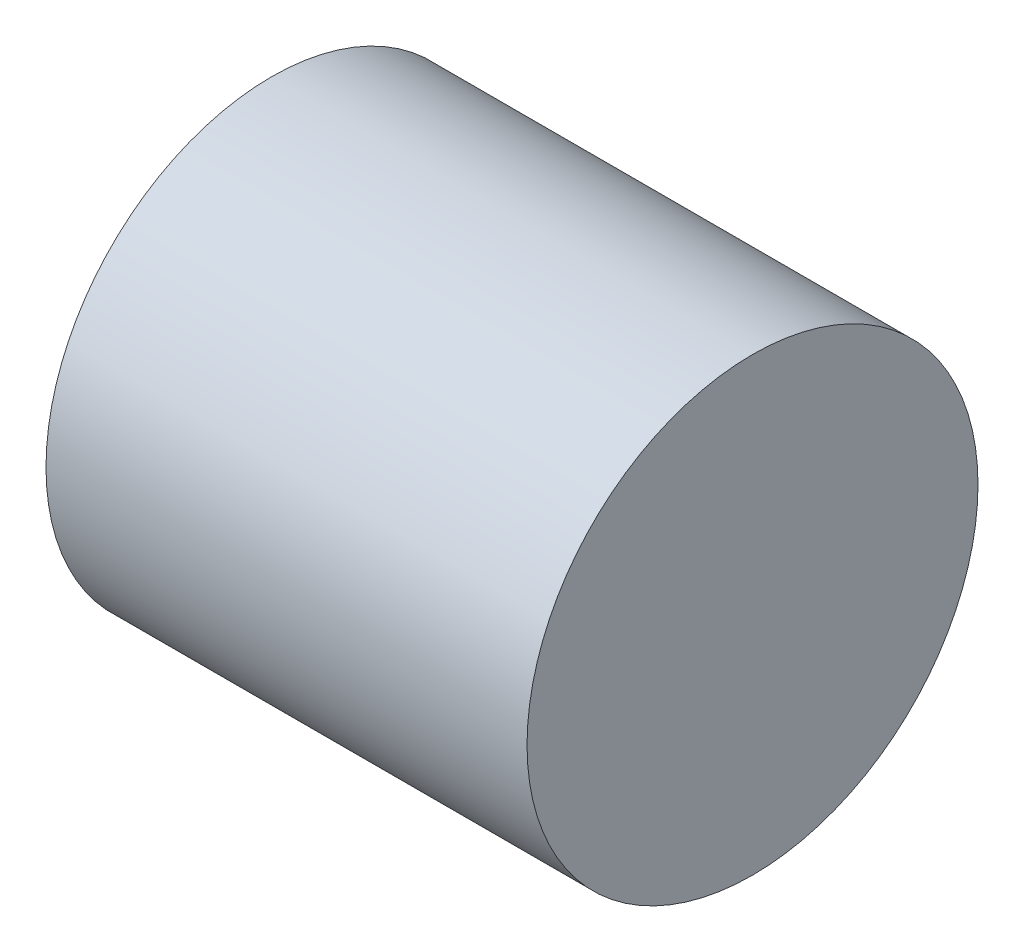
ISO-10303-21;
HEADER;
FILE_DESCRIPTION(('STEP AP214'),'2;1');
FILE_NAME('part.step','',(''),(''),'','','');
FILE_SCHEMA(('AUTOMOTIVE_DESIGN { 1 0 10303 214 1 1 1 1 }'));
ENDSEC;
DATA;
#1=APPLICATION_CONTEXT('core data for automotive mechanical design processes');
#2=APPLICATION_PROTOCOL_DEFINITION('international standard','automotive_design',2000,#1);
#3=PRODUCT_CONTEXT('',#1,'mechanical');
#4=PRODUCT('Part','Part','',(#3));
#5=PRODUCT_RELATED_PRODUCT_CATEGORY('part','',(#4));
#6=PRODUCT_DEFINITION_FORMATION('','',#4);
#7=PRODUCT_DEFINITION_CONTEXT('part definition',#1,'design');
#8=PRODUCT_DEFINITION('design','',#6,#7);
#9=PRODUCT_DEFINITION_SHAPE('','',#8);
#10=(LENGTH_UNIT() NAMED_UNIT(*) SI_UNIT(.MILLI.,.METRE.));
#11=(NAMED_UNIT(*) PLANE_ANGLE_UNIT() SI_UNIT($,.RADIAN.));
#12=(NAMED_UNIT(*) SI_UNIT($,.STERADIAN.) SOLID_ANGLE_UNIT());
#13=UNCERTAINTY_MEASURE_WITH_UNIT(LENGTH_MEASURE(1.E-05),#10,'distance_accuracy_value','');
#14=(GEOMETRIC_REPRESENTATION_CONTEXT(3) GLOBAL_UNCERTAINTY_ASSIGNED_CONTEXT((#13)) GLOBAL_UNIT_ASSIGNED_CONTEXT((#10,
#11,#12)) REPRESENTATION_CONTEXT('',''));
#15=CARTESIAN_POINT('',(0.,0.,0.));
#16=DIRECTION('',(0.,0.,1.));
#17=DIRECTION('',(1.,0.,0.));
#18=AXIS2_PLACEMENT_3D('',#15,#16,#17);
#19=CARTESIAN_POINT('',(17.6851851851852,0.,0.));
#20=DIRECTION('',(-1.,0.,0.));
#21=DIRECTION('',(0.,0.,1.));
#22=AXIS2_PLACEMENT_3D('',#19,#20,#21);
#23=PLANE('',#22);
#24=CARTESIAN_POINT('',(17.6851851851852,0.,0.));
#25=DIRECTION('',(-1.,0.,0.));
#26=DIRECTION('',(0.,0.,1.));
#27=AXIS2_PLACEMENT_3D('',#24,#25,#26);
#28=CIRCLE('',#27,15.);
#29=CARTESIAN_POINT('',(17.6851851851852,0.,15.));
#30=VERTEX_POINT('',#29);
#31=EDGE_CURVE('E10',#30,#30,#28,.T.);
#32=ORIENTED_EDGE('',*,*,#31,.F.);
#33=EDGE_LOOP('',(#32));
#34=FACE_BOUND('',#33,.T.);
#35=ADVANCED_FACE('F41',(#34),#23,.F.);
#36=CARTESIAN_POINT('',(-19.537037037037,0.,0.));
#37=DIRECTION('',(-1.,0.,0.));
#38=DIRECTION('',(0.,0.,1.));
#39=AXIS2_PLACEMENT_3D('',#36,#37,#38);
#40=CYLINDRICAL_SURFACE('',#39,15.);
#41=CARTESIAN_POINT('',(-14.3148148148148,0.,0.));
#42=DIRECTION('',(-1.,0.,0.));
#43=DIRECTION('',(0.,0.,1.));
#44=AXIS2_PLACEMENT_3D('',#41,#42,#43);
#45=CIRCLE('',#44,15.);
#46=CARTESIAN_POINT('',(-14.3148148148148,0.,15.));
#47=VERTEX_POINT('',#46);
#48=EDGE_CURVE('E48',#47,#47,#45,.T.);
#49=ORIENTED_EDGE('',*,*,#48,.F.);
#50=EDGE_LOOP('',(#49));
#51=FACE_BOUND('',#50,.T.);
#52=ORIENTED_EDGE('',*,*,#31,.T.);
#53=EDGE_LOOP('',(#52));
#54=FACE_BOUND('',#53,.T.);
#55=ADVANCED_FACE('F75',(#51,#54),#40,.T.);
#56=CARTESIAN_POINT('',(-14.3148148148148,15.,0.));
#57=DIRECTION('',(1.,0.,0.));
#58=DIRECTION('',(0.,0.,-1.));
#59=AXIS2_PLACEMENT_3D('',#56,#57,#58);
#60=PLANE('',#59);
#61=CARTESIAN_POINT('',(-14.3148148148148,0.,0.));
#62=DIRECTION('',(-1.,0.,0.));
#63=DIRECTION('',(0.,0.,1.));
#64=AXIS2_PLACEMENT_3D('',#61,#62,#63);
#65=CIRCLE('',#64,1.);
#66=CARTESIAN_POINT('',(-14.3148148148148,0.,1.));
#67=VERTEX_POINT('',#66);
#68=EDGE_CURVE('E53',#67,#67,#65,.T.);
#69=ORIENTED_EDGE('',*,*,#68,.F.);
#70=EDGE_LOOP('',(#69));
#71=FACE_BOUND('',#70,.T.);
#72=ORIENTED_EDGE('',*,*,#48,.T.);
#73=EDGE_LOOP('',(#72));
#74=FACE_BOUND('',#73,.T.);
#75=ADVANCED_FACE('F70',(#71,#74),#60,.F.);
#76=CARTESIAN_POINT('',(-19.537037037037,0.,0.));
#77=DIRECTION('',(-1.,0.,0.));
#78=DIRECTION('',(0.,0.,1.));
#79=AXIS2_PLACEMENT_3D('',#76,#77,#78);
#80=CYLINDRICAL_SURFACE('',#79,1.);
#81=CARTESIAN_POINT('',(-12.3148148148148,0.,0.));
#82=DIRECTION('',(-1.,0.,0.));
#83=DIRECTION('',(0.,0.,1.));
#84=AXIS2_PLACEMENT_3D('',#81,#82,#83);
#85=CIRCLE('',#84,1.);
#86=CARTESIAN_POINT('',(-12.3148148148148,0.,1.));
#87=VERTEX_POINT('',#86);
#88=EDGE_CURVE('E58',#87,#87,#85,.T.);
#89=ORIENTED_EDGE('',*,*,#88,.F.);
#90=EDGE_LOOP('',(#89));
#91=FACE_BOUND('',#90,.T.);
#92=ORIENTED_EDGE('',*,*,#68,.T.);
#93=EDGE_LOOP('',(#92));
#94=FACE_BOUND('',#93,.T.);
#95=ADVANCED_FACE('F67',(#91,#94),#80,.F.);
#96=CARTESIAN_POINT('',(-12.3148148148148,1.,0.));
#97=DIRECTION('',(1.,0.,0.));
#98=DIRECTION('',(0.,0.,-1.));
#99=AXIS2_PLACEMENT_3D('',#96,#97,#98);
#100=PLANE('',#99);
#101=ORIENTED_EDGE('',*,*,#88,.T.);
#102=EDGE_LOOP('',(#101));
#103=FACE_BOUND('',#102,.T.);
#104=ADVANCED_FACE('F65',(#103),#100,.F.);
#105=CLOSED_SHELL('',(#35,#55,#75,#95,#104));
#106=MANIFOLD_SOLID_BREP('B2',#105);
#107=ADVANCED_BREP_SHAPE_REPRESENTATION('',(#18,#106),#14);
#108=SHAPE_DEFINITION_REPRESENTATION(#9,#107);
ENDSEC;
END-ISO-10303-21;
